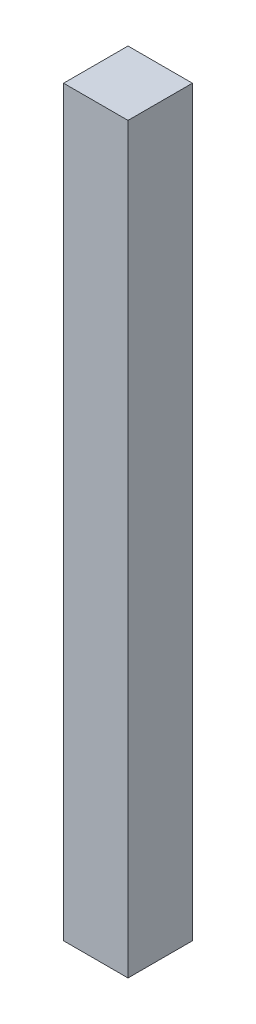
ISO-10303-21;
HEADER;
FILE_DESCRIPTION(('STEP AP214'),'2;1');
FILE_NAME('part.step','',(''),(''),'','','');
FILE_SCHEMA(('AUTOMOTIVE_DESIGN { 1 0 10303 214 1 1 1 1 }'));
ENDSEC;
DATA;
#1=APPLICATION_CONTEXT('core data for automotive mechanical design processes');
#2=APPLICATION_PROTOCOL_DEFINITION('international standard','automotive_design',2000,#1);
#3=PRODUCT_CONTEXT('',#1,'mechanical');
#4=PRODUCT('Part','Part','',(#3));
#5=PRODUCT_RELATED_PRODUCT_CATEGORY('part','',(#4));
#6=PRODUCT_DEFINITION_FORMATION('','',#4);
#7=PRODUCT_DEFINITION_CONTEXT('part definition',#1,'design');
#8=PRODUCT_DEFINITION('design','',#6,#7);
#9=PRODUCT_DEFINITION_SHAPE('','',#8);
#10=(LENGTH_UNIT() NAMED_UNIT(*) SI_UNIT(.MILLI.,.METRE.));
#11=(NAMED_UNIT(*) PLANE_ANGLE_UNIT() SI_UNIT($,.RADIAN.));
#12=(NAMED_UNIT(*) SI_UNIT($,.STERADIAN.) SOLID_ANGLE_UNIT());
#13=UNCERTAINTY_MEASURE_WITH_UNIT(LENGTH_MEASURE(1.E-05),#10,'distance_accuracy_value','');
#14=(GEOMETRIC_REPRESENTATION_CONTEXT(3) GLOBAL_UNCERTAINTY_ASSIGNED_CONTEXT((#13)) GLOBAL_UNIT_ASSIGNED_CONTEXT((#10,
#11,#12)) REPRESENTATION_CONTEXT('',''));
#15=CARTESIAN_POINT('',(0.,0.,0.));
#16=DIRECTION('',(0.,0.,1.));
#17=DIRECTION('',(1.,0.,0.));
#18=AXIS2_PLACEMENT_3D('',#15,#16,#17);
#19=CARTESIAN_POINT('',(12.7,292.85,12.7));
#20=DIRECTION('',(-1.,0.,0.));
#21=DIRECTION('',(0.,0.,1.));
#22=AXIS2_PLACEMENT_3D('',#19,#20,#21);
#23=PLANE('',#22);
#24=DIRECTION('',(0.,0.,-1.));
#25=VECTOR('',#24,1.);
#26=CARTESIAN_POINT('',(12.7,0.,12.7));
#27=LINE('',#26,#25);
#28=CARTESIAN_POINT('',(12.7,0.,12.7));
#29=VERTEX_POINT('',#28);
#30=CARTESIAN_POINT('',(12.7,0.,-12.7));
#31=VERTEX_POINT('',#30);
#32=EDGE_CURVE('E99',#29,#31,#27,.T.);
#33=ORIENTED_EDGE('',*,*,#32,.T.);
#34=DIRECTION('',(0.,-1.,0.));
#35=VECTOR('',#34,1.);
#36=CARTESIAN_POINT('',(12.7,292.85,-12.7));
#37=LINE('',#36,#35);
#38=CARTESIAN_POINT('',(12.7,292.85,-12.7));
#39=VERTEX_POINT('',#38);
#40=EDGE_CURVE('E11',#39,#31,#37,.T.);
#41=ORIENTED_EDGE('',*,*,#40,.F.);
#42=DIRECTION('',(0.,0.,-1.));
#43=VECTOR('',#42,1.);
#44=CARTESIAN_POINT('',(12.7,292.85,12.7));
#45=LINE('',#44,#43);
#46=CARTESIAN_POINT('',(12.7,292.85,12.7));
#47=VERTEX_POINT('',#46);
#48=EDGE_CURVE('E87',#47,#39,#45,.T.);
#49=ORIENTED_EDGE('',*,*,#48,.F.);
#50=DIRECTION('',(0.,-1.,0.));
#51=VECTOR('',#50,1.);
#52=CARTESIAN_POINT('',(12.7,292.85,12.7));
#53=LINE('',#52,#51);
#54=EDGE_CURVE('E95',#47,#29,#53,.T.);
#55=ORIENTED_EDGE('',*,*,#54,.T.);
#56=EDGE_LOOP('',(#33,#41,#49,#55));
#57=FACE_BOUND('',#56,.T.);
#58=ADVANCED_FACE('F36',(#57),#23,.F.);
#59=CARTESIAN_POINT('',(-12.7,292.85,-12.7));
#60=DIRECTION('',(0.,0.,1.));
#61=DIRECTION('',(1.,0.,0.));
#62=AXIS2_PLACEMENT_3D('',#59,#60,#61);
#63=PLANE('',#62);
#64=DIRECTION('',(-1.,0.,0.));
#65=VECTOR('',#64,1.);
#66=CARTESIAN_POINT('',(-12.7,0.,-12.7));
#67=LINE('',#66,#65);
#68=CARTESIAN_POINT('',(-12.7,0.,-12.7));
#69=VERTEX_POINT('',#68);
#70=EDGE_CURVE('E91',#31,#69,#67,.T.);
#71=ORIENTED_EDGE('',*,*,#70,.T.);
#72=DIRECTION('',(0.,-1.,0.));
#73=VECTOR('',#72,1.);
#74=CARTESIAN_POINT('',(-12.7,292.85,-12.7));
#75=LINE('',#74,#73);
#76=CARTESIAN_POINT('',(-12.7,292.85,-12.7));
#77=VERTEX_POINT('',#76);
#78=EDGE_CURVE('E44',#77,#69,#75,.T.);
#79=ORIENTED_EDGE('',*,*,#78,.F.);
#80=DIRECTION('',(-1.,0.,0.));
#81=VECTOR('',#80,1.);
#82=CARTESIAN_POINT('',(-12.7,292.85,-12.7));
#83=LINE('',#82,#81);
#84=EDGE_CURVE('E82',#39,#77,#83,.T.);
#85=ORIENTED_EDGE('',*,*,#84,.F.);
#86=ORIENTED_EDGE('',*,*,#40,.T.);
#87=EDGE_LOOP('',(#71,#79,#85,#86));
#88=FACE_BOUND('',#87,.T.);
#89=ADVANCED_FACE('F90',(#88),#63,.F.);
#90=CARTESIAN_POINT('',(-12.7,292.85,12.7));
#91=DIRECTION('',(1.,0.,0.));
#92=DIRECTION('',(0.,0.,-1.));
#93=AXIS2_PLACEMENT_3D('',#90,#91,#92);
#94=PLANE('',#93);
#95=DIRECTION('',(0.,0.,1.));
#96=VECTOR('',#95,1.);
#97=CARTESIAN_POINT('',(-12.7,0.,12.7));
#98=LINE('',#97,#96);
#99=CARTESIAN_POINT('',(-12.7,0.,12.7));
#100=VERTEX_POINT('',#99);
#101=EDGE_CURVE('E69',#69,#100,#98,.T.);
#102=ORIENTED_EDGE('',*,*,#101,.T.);
#103=DIRECTION('',(0.,-1.,0.));
#104=VECTOR('',#103,1.);
#105=CARTESIAN_POINT('',(-12.7,292.85,12.7));
#106=LINE('',#105,#104);
#107=CARTESIAN_POINT('',(-12.7,292.85,12.7));
#108=VERTEX_POINT('',#107);
#109=EDGE_CURVE('E92',#108,#100,#106,.T.);
#110=ORIENTED_EDGE('',*,*,#109,.F.);
#111=DIRECTION('',(0.,0.,1.));
#112=VECTOR('',#111,1.);
#113=CARTESIAN_POINT('',(-12.7,292.85,12.7));
#114=LINE('',#113,#112);
#115=EDGE_CURVE('E85',#77,#108,#114,.T.);
#116=ORIENTED_EDGE('',*,*,#115,.F.);
#117=ORIENTED_EDGE('',*,*,#78,.T.);
#118=EDGE_LOOP('',(#102,#110,#116,#117));
#119=FACE_BOUND('',#118,.T.);
#120=ADVANCED_FACE('F93',(#119),#94,.F.);
#121=CARTESIAN_POINT('',(-12.7,292.85,12.7));
#122=DIRECTION('',(0.,0.,-1.));
#123=DIRECTION('',(-1.,0.,0.));
#124=AXIS2_PLACEMENT_3D('',#121,#122,#123);
#125=PLANE('',#124);
#126=DIRECTION('',(1.,0.,0.));
#127=VECTOR('',#126,1.);
#128=CARTESIAN_POINT('',(-12.7,0.,12.7));
#129=LINE('',#128,#127);
#130=EDGE_CURVE('E75',#100,#29,#129,.T.);
#131=ORIENTED_EDGE('',*,*,#130,.T.);
#132=ORIENTED_EDGE('',*,*,#54,.F.);
#133=DIRECTION('',(1.,0.,0.));
#134=VECTOR('',#133,1.);
#135=CARTESIAN_POINT('',(-12.7,292.85,12.7));
#136=LINE('',#135,#134);
#137=EDGE_CURVE('E52',#108,#47,#136,.T.);
#138=ORIENTED_EDGE('',*,*,#137,.F.);
#139=ORIENTED_EDGE('',*,*,#109,.T.);
#140=EDGE_LOOP('',(#131,#132,#138,#139));
#141=FACE_BOUND('',#140,.T.);
#142=ADVANCED_FACE('F106',(#141),#125,.F.);
#143=CARTESIAN_POINT('',(0.,292.85,0.));
#144=DIRECTION('',(0.,-1.,0.));
#145=DIRECTION('',(0.,0.,-1.));
#146=AXIS2_PLACEMENT_3D('',#143,#144,#145);
#147=PLANE('',#146);
#148=ORIENTED_EDGE('',*,*,#48,.T.);
#149=ORIENTED_EDGE('',*,*,#84,.T.);
#150=ORIENTED_EDGE('',*,*,#115,.T.);
#151=ORIENTED_EDGE('',*,*,#137,.T.);
#152=EDGE_LOOP('',(#148,#149,#150,#151));
#153=FACE_BOUND('',#152,.T.);
#154=ADVANCED_FACE('F83',(#153),#147,.F.);
#155=CARTESIAN_POINT('',(0.,0.,0.));
#156=DIRECTION('',(0.,-1.,0.));
#157=DIRECTION('',(0.,0.,-1.));
#158=AXIS2_PLACEMENT_3D('',#155,#156,#157);
#159=PLANE('',#158);
#160=ORIENTED_EDGE('',*,*,#32,.F.);
#161=ORIENTED_EDGE('',*,*,#130,.F.);
#162=ORIENTED_EDGE('',*,*,#101,.F.);
#163=ORIENTED_EDGE('',*,*,#70,.F.);
#164=EDGE_LOOP('',(#160,#161,#162,#163));
#165=FACE_BOUND('',#164,.T.);
#166=ADVANCED_FACE('F109',(#165),#159,.T.);
#167=CLOSED_SHELL('',(#58,#89,#120,#142,#154,#166));
#168=MANIFOLD_SOLID_BREP('B2',#167);
#169=ADVANCED_BREP_SHAPE_REPRESENTATION('',(#18,#168),#14);
#170=SHAPE_DEFINITION_REPRESENTATION(#9,#169);
ENDSEC;
END-ISO-10303-21;
